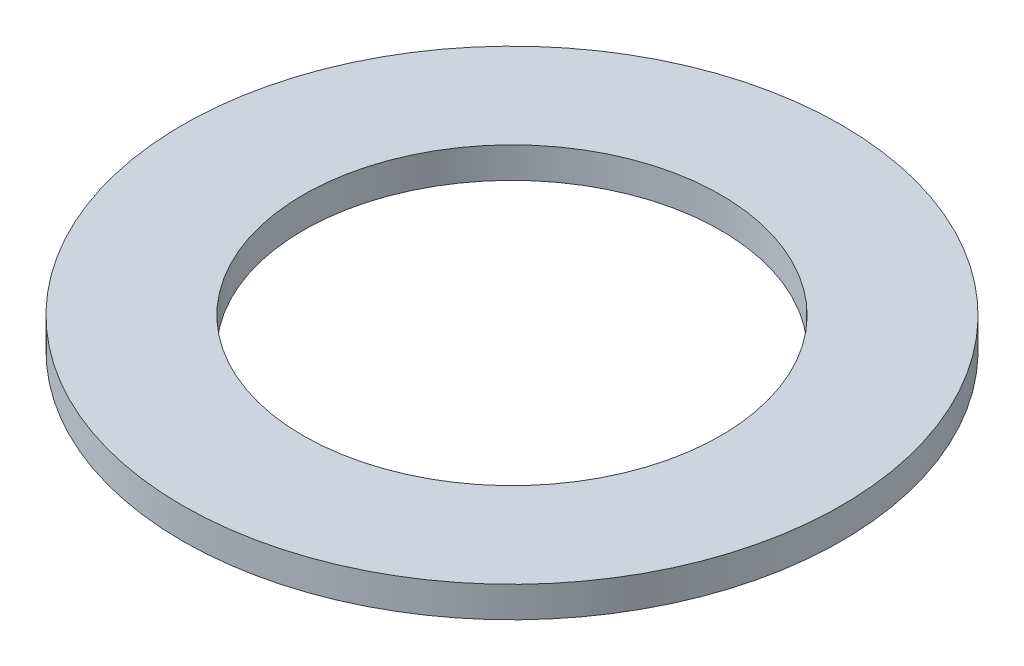
ISO-10303-21;
HEADER;
FILE_DESCRIPTION(('STEP AP214'),'2;1');
FILE_NAME('part.step','',(''),(''),'','','');
FILE_SCHEMA(('AUTOMOTIVE_DESIGN { 1 0 10303 214 1 1 1 1 }'));
ENDSEC;
DATA;
#1=APPLICATION_CONTEXT('core data for automotive mechanical design processes');
#2=APPLICATION_PROTOCOL_DEFINITION('international standard','automotive_design',2000,#1);
#3=PRODUCT_CONTEXT('',#1,'mechanical');
#4=PRODUCT('Part','Part','',(#3));
#5=PRODUCT_RELATED_PRODUCT_CATEGORY('part','',(#4));
#6=PRODUCT_DEFINITION_FORMATION('','',#4);
#7=PRODUCT_DEFINITION_CONTEXT('part definition',#1,'design');
#8=PRODUCT_DEFINITION('design','',#6,#7);
#9=PRODUCT_DEFINITION_SHAPE('','',#8);
#10=(LENGTH_UNIT() NAMED_UNIT(*) SI_UNIT(.MILLI.,.METRE.));
#11=(NAMED_UNIT(*) PLANE_ANGLE_UNIT() SI_UNIT($,.RADIAN.));
#12=(NAMED_UNIT(*) SI_UNIT($,.STERADIAN.) SOLID_ANGLE_UNIT());
#13=UNCERTAINTY_MEASURE_WITH_UNIT(LENGTH_MEASURE(1.E-05),#10,'distance_accuracy_value','');
#14=(GEOMETRIC_REPRESENTATION_CONTEXT(3) GLOBAL_UNCERTAINTY_ASSIGNED_CONTEXT((#13)) GLOBAL_UNIT_ASSIGNED_CONTEXT((#10,
#11,#12)) REPRESENTATION_CONTEXT('',''));
#15=CARTESIAN_POINT('',(0.,0.,0.));
#16=DIRECTION('',(0.,0.,1.));
#17=DIRECTION('',(1.,0.,0.));
#18=AXIS2_PLACEMENT_3D('',#15,#16,#17);
#19=CARTESIAN_POINT('',(0.,7.,0.));
#20=DIRECTION('',(0.,-1.,0.));
#21=DIRECTION('',(0.,0.,-1.));
#22=AXIS2_PLACEMENT_3D('',#19,#20,#21);
#23=CYLINDRICAL_SURFACE('',#22,75.);
#24=CARTESIAN_POINT('',(0.,7.,0.));
#25=DIRECTION('',(0.,1.,0.));
#26=DIRECTION('',(0.,0.,1.));
#27=AXIS2_PLACEMENT_3D('',#24,#25,#26);
#28=CIRCLE('',#27,75.);
#29=CARTESIAN_POINT('',(0.,7.,75.));
#30=VERTEX_POINT('',#29);
#31=EDGE_CURVE('E10',#30,#30,#28,.T.);
#32=ORIENTED_EDGE('',*,*,#31,.F.);
#33=EDGE_LOOP('',(#32));
#34=FACE_BOUND('',#33,.T.);
#35=CARTESIAN_POINT('',(0.,0.,0.));
#36=DIRECTION('',(0.,1.,0.));
#37=DIRECTION('',(0.,0.,1.));
#38=AXIS2_PLACEMENT_3D('',#35,#36,#37);
#39=CIRCLE('',#38,75.);
#40=CARTESIAN_POINT('',(0.,0.,75.));
#41=VERTEX_POINT('',#40);
#42=EDGE_CURVE('E37',#41,#41,#39,.T.);
#43=ORIENTED_EDGE('',*,*,#42,.T.);
#44=EDGE_LOOP('',(#43));
#45=FACE_BOUND('',#44,.T.);
#46=ADVANCED_FACE('F40',(#34,#45),#23,.T.);
#47=CARTESIAN_POINT('',(0.,7.,0.));
#48=DIRECTION('',(0.,1.,0.));
#49=DIRECTION('',(0.,0.,1.));
#50=AXIS2_PLACEMENT_3D('',#47,#48,#49);
#51=PLANE('',#50);
#52=CARTESIAN_POINT('',(0.,7.,0.));
#53=DIRECTION('',(0.,1.,0.));
#54=DIRECTION('',(0.,0.,1.));
#55=AXIS2_PLACEMENT_3D('',#52,#53,#54);
#56=CIRCLE('',#55,47.5);
#57=CARTESIAN_POINT('',(0.,7.,47.5));
#58=VERTEX_POINT('',#57);
#59=EDGE_CURVE('E50',#58,#58,#56,.T.);
#60=ORIENTED_EDGE('',*,*,#59,.F.);
#61=EDGE_LOOP('',(#60));
#62=FACE_BOUND('',#61,.T.);
#63=ORIENTED_EDGE('',*,*,#31,.T.);
#64=EDGE_LOOP('',(#63));
#65=FACE_BOUND('',#64,.T.);
#66=ADVANCED_FACE('F59',(#62,#65),#51,.T.);
#67=CARTESIAN_POINT('',(0.,0.,0.));
#68=DIRECTION('',(0.,1.,0.));
#69=DIRECTION('',(0.,0.,1.));
#70=AXIS2_PLACEMENT_3D('',#67,#68,#69);
#71=PLANE('',#70);
#72=CARTESIAN_POINT('',(0.,0.,0.));
#73=DIRECTION('',(0.,1.,0.));
#74=DIRECTION('',(0.,0.,1.));
#75=AXIS2_PLACEMENT_3D('',#72,#73,#74);
#76=CIRCLE('',#75,47.5);
#77=CARTESIAN_POINT('',(0.,0.,47.5));
#78=VERTEX_POINT('',#77);
#79=EDGE_CURVE('E47',#78,#78,#76,.T.);
#80=ORIENTED_EDGE('',*,*,#79,.T.);
#81=EDGE_LOOP('',(#80));
#82=FACE_BOUND('',#81,.T.);
#83=ORIENTED_EDGE('',*,*,#42,.F.);
#84=EDGE_LOOP('',(#83));
#85=FACE_BOUND('',#84,.T.);
#86=ADVANCED_FACE('F58',(#82,#85),#71,.F.);
#87=CARTESIAN_POINT('',(0.,7.,0.));
#88=DIRECTION('',(0.,-1.,0.));
#89=DIRECTION('',(0.,0.,-1.));
#90=AXIS2_PLACEMENT_3D('',#87,#88,#89);
#91=CYLINDRICAL_SURFACE('',#90,47.5);
#92=ORIENTED_EDGE('',*,*,#59,.T.);
#93=EDGE_LOOP('',(#92));
#94=FACE_BOUND('',#93,.T.);
#95=ORIENTED_EDGE('',*,*,#79,.F.);
#96=EDGE_LOOP('',(#95));
#97=FACE_BOUND('',#96,.T.);
#98=ADVANCED_FACE('F54',(#94,#97),#91,.F.);
#99=CLOSED_SHELL('',(#46,#66,#86,#98));
#100=MANIFOLD_SOLID_BREP('B2',#99);
#101=ADVANCED_BREP_SHAPE_REPRESENTATION('',(#18,#100),#14);
#102=SHAPE_DEFINITION_REPRESENTATION(#9,#101);
ENDSEC;
END-ISO-10303-21;
